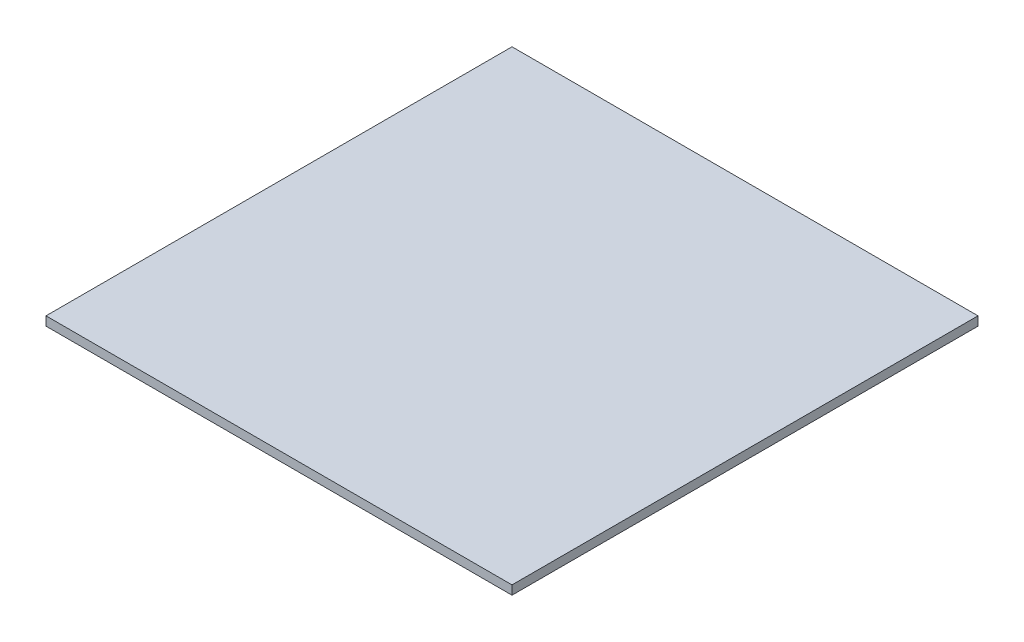
ISO-10303-21;
HEADER;
FILE_DESCRIPTION(('STEP AP214'),'2;1');
FILE_NAME('part.step','',(''),(''),'','','');
FILE_SCHEMA(('AUTOMOTIVE_DESIGN { 1 0 10303 214 1 1 1 1 }'));
ENDSEC;
DATA;
#1=APPLICATION_CONTEXT('core data for automotive mechanical design processes');
#2=APPLICATION_PROTOCOL_DEFINITION('international standard','automotive_design',2000,#1);
#3=PRODUCT_CONTEXT('',#1,'mechanical');
#4=PRODUCT('Part','Part','',(#3));
#5=PRODUCT_RELATED_PRODUCT_CATEGORY('part','',(#4));
#6=PRODUCT_DEFINITION_FORMATION('','',#4);
#7=PRODUCT_DEFINITION_CONTEXT('part definition',#1,'design');
#8=PRODUCT_DEFINITION('design','',#6,#7);
#9=PRODUCT_DEFINITION_SHAPE('','',#8);
#10=(LENGTH_UNIT() NAMED_UNIT(*) SI_UNIT(.MILLI.,.METRE.));
#11=(NAMED_UNIT(*) PLANE_ANGLE_UNIT() SI_UNIT($,.RADIAN.));
#12=(NAMED_UNIT(*) SI_UNIT($,.STERADIAN.) SOLID_ANGLE_UNIT());
#13=UNCERTAINTY_MEASURE_WITH_UNIT(LENGTH_MEASURE(1.E-05),#10,'distance_accuracy_value','');
#14=(GEOMETRIC_REPRESENTATION_CONTEXT(3) GLOBAL_UNCERTAINTY_ASSIGNED_CONTEXT((#13)) GLOBAL_UNIT_ASSIGNED_CONTEXT((#10,
#11,#12)) REPRESENTATION_CONTEXT('',''));
#15=CARTESIAN_POINT('',(0.,0.,0.));
#16=DIRECTION('',(0.,0.,1.));
#17=DIRECTION('',(1.,0.,0.));
#18=AXIS2_PLACEMENT_3D('',#15,#16,#17);
#19=CARTESIAN_POINT('',(65.,2.5,65.));
#20=DIRECTION('',(-1.,0.,0.));
#21=DIRECTION('',(0.,0.,1.));
#22=AXIS2_PLACEMENT_3D('',#19,#20,#21);
#23=PLANE('',#22);
#24=DIRECTION('',(0.,0.,-1.));
#25=VECTOR('',#24,1.);
#26=CARTESIAN_POINT('',(65.,0.,65.));
#27=LINE('',#26,#25);
#28=CARTESIAN_POINT('',(65.,0.,65.));
#29=VERTEX_POINT('',#28);
#30=CARTESIAN_POINT('',(65.,0.,-65.));
#31=VERTEX_POINT('',#30);
#32=EDGE_CURVE('E107',#29,#31,#27,.T.);
#33=ORIENTED_EDGE('',*,*,#32,.T.);
#34=DIRECTION('',(0.,-1.,0.));
#35=VECTOR('',#34,1.);
#36=CARTESIAN_POINT('',(65.,2.5,-65.));
#37=LINE('',#36,#35);
#38=CARTESIAN_POINT('',(65.,2.5,-65.));
#39=VERTEX_POINT('',#38);
#40=EDGE_CURVE('E11',#39,#31,#37,.T.);
#41=ORIENTED_EDGE('',*,*,#40,.F.);
#42=DIRECTION('',(0.,0.,-1.));
#43=VECTOR('',#42,1.);
#44=CARTESIAN_POINT('',(65.,2.5,65.));
#45=LINE('',#44,#43);
#46=CARTESIAN_POINT('',(65.,2.5,65.));
#47=VERTEX_POINT('',#46);
#48=EDGE_CURVE('E91',#47,#39,#45,.T.);
#49=ORIENTED_EDGE('',*,*,#48,.F.);
#50=DIRECTION('',(0.,-1.,0.));
#51=VECTOR('',#50,1.);
#52=CARTESIAN_POINT('',(65.,2.5,65.));
#53=LINE('',#52,#51);
#54=EDGE_CURVE('E103',#47,#29,#53,.T.);
#55=ORIENTED_EDGE('',*,*,#54,.T.);
#56=EDGE_LOOP('',(#33,#41,#49,#55));
#57=FACE_BOUND('',#56,.T.);
#58=ADVANCED_FACE('F39',(#57),#23,.F.);
#59=CARTESIAN_POINT('',(-65.,2.5,-65.));
#60=DIRECTION('',(0.,0.,1.));
#61=DIRECTION('',(1.,0.,0.));
#62=AXIS2_PLACEMENT_3D('',#59,#60,#61);
#63=PLANE('',#62);
#64=DIRECTION('',(-1.,0.,0.));
#65=VECTOR('',#64,1.);
#66=CARTESIAN_POINT('',(-65.,0.,-65.));
#67=LINE('',#66,#65);
#68=CARTESIAN_POINT('',(-65.,0.,-65.));
#69=VERTEX_POINT('',#68);
#70=EDGE_CURVE('E96',#31,#69,#67,.T.);
#71=ORIENTED_EDGE('',*,*,#70,.T.);
#72=DIRECTION('',(0.,-1.,0.));
#73=VECTOR('',#72,1.);
#74=CARTESIAN_POINT('',(-65.,2.5,-65.));
#75=LINE('',#74,#73);
#76=CARTESIAN_POINT('',(-65.,2.5,-65.));
#77=VERTEX_POINT('',#76);
#78=EDGE_CURVE('E48',#77,#69,#75,.T.);
#79=ORIENTED_EDGE('',*,*,#78,.F.);
#80=DIRECTION('',(-1.,0.,0.));
#81=VECTOR('',#80,1.);
#82=CARTESIAN_POINT('',(-65.,2.5,-65.));
#83=LINE('',#82,#81);
#84=EDGE_CURVE('E86',#39,#77,#83,.T.);
#85=ORIENTED_EDGE('',*,*,#84,.F.);
#86=ORIENTED_EDGE('',*,*,#40,.T.);
#87=EDGE_LOOP('',(#71,#79,#85,#86));
#88=FACE_BOUND('',#87,.T.);
#89=ADVANCED_FACE('F95',(#88),#63,.F.);
#90=CARTESIAN_POINT('',(-65.,2.5,65.));
#91=DIRECTION('',(1.,0.,0.));
#92=DIRECTION('',(0.,0.,-1.));
#93=AXIS2_PLACEMENT_3D('',#90,#91,#92);
#94=PLANE('',#93);
#95=DIRECTION('',(0.,0.,1.));
#96=VECTOR('',#95,1.);
#97=CARTESIAN_POINT('',(-65.,0.,65.));
#98=LINE('',#97,#96);
#99=CARTESIAN_POINT('',(-65.,0.,65.));
#100=VERTEX_POINT('',#99);
#101=EDGE_CURVE('E73',#69,#100,#98,.T.);
#102=ORIENTED_EDGE('',*,*,#101,.T.);
#103=DIRECTION('',(0.,-1.,0.));
#104=VECTOR('',#103,1.);
#105=CARTESIAN_POINT('',(-65.,2.5,65.));
#106=LINE('',#105,#104);
#107=CARTESIAN_POINT('',(-65.,2.5,65.));
#108=VERTEX_POINT('',#107);
#109=EDGE_CURVE('E98',#108,#100,#106,.T.);
#110=ORIENTED_EDGE('',*,*,#109,.F.);
#111=DIRECTION('',(0.,0.,1.));
#112=VECTOR('',#111,1.);
#113=CARTESIAN_POINT('',(-65.,2.5,65.));
#114=LINE('',#113,#112);
#115=EDGE_CURVE('E89',#77,#108,#114,.T.);
#116=ORIENTED_EDGE('',*,*,#115,.F.);
#117=ORIENTED_EDGE('',*,*,#78,.T.);
#118=EDGE_LOOP('',(#102,#110,#116,#117));
#119=FACE_BOUND('',#118,.T.);
#120=ADVANCED_FACE('F99',(#119),#94,.F.);
#121=CARTESIAN_POINT('',(-65.,2.5,65.));
#122=DIRECTION('',(0.,0.,-1.));
#123=DIRECTION('',(-1.,0.,0.));
#124=AXIS2_PLACEMENT_3D('',#121,#122,#123);
#125=PLANE('',#124);
#126=DIRECTION('',(1.,0.,0.));
#127=VECTOR('',#126,1.);
#128=CARTESIAN_POINT('',(-65.,0.,65.));
#129=LINE('',#128,#127);
#130=EDGE_CURVE('E79',#100,#29,#129,.T.);
#131=ORIENTED_EDGE('',*,*,#130,.T.);
#132=ORIENTED_EDGE('',*,*,#54,.F.);
#133=DIRECTION('',(1.,0.,0.));
#134=VECTOR('',#133,1.);
#135=CARTESIAN_POINT('',(-65.,2.5,65.));
#136=LINE('',#135,#134);
#137=EDGE_CURVE('E56',#108,#47,#136,.T.);
#138=ORIENTED_EDGE('',*,*,#137,.F.);
#139=ORIENTED_EDGE('',*,*,#109,.T.);
#140=EDGE_LOOP('',(#131,#132,#138,#139));
#141=FACE_BOUND('',#140,.T.);
#142=ADVANCED_FACE('F120',(#141),#125,.F.);
#143=CARTESIAN_POINT('',(0.,2.5,0.));
#144=DIRECTION('',(0.,-1.,0.));
#145=DIRECTION('',(0.,0.,-1.));
#146=AXIS2_PLACEMENT_3D('',#143,#144,#145);
#147=PLANE('',#146);
#148=ORIENTED_EDGE('',*,*,#48,.T.);
#149=ORIENTED_EDGE('',*,*,#84,.T.);
#150=ORIENTED_EDGE('',*,*,#115,.T.);
#151=ORIENTED_EDGE('',*,*,#137,.T.);
#152=EDGE_LOOP('',(#148,#149,#150,#151));
#153=FACE_BOUND('',#152,.T.);
#154=ADVANCED_FACE('F87',(#153),#147,.F.);
#155=CARTESIAN_POINT('',(0.,0.,0.));
#156=DIRECTION('',(0.,-1.,0.));
#157=DIRECTION('',(0.,0.,-1.));
#158=AXIS2_PLACEMENT_3D('',#155,#156,#157);
#159=PLANE('',#158);
#160=ORIENTED_EDGE('',*,*,#32,.F.);
#161=ORIENTED_EDGE('',*,*,#130,.F.);
#162=ORIENTED_EDGE('',*,*,#101,.F.);
#163=ORIENTED_EDGE('',*,*,#70,.F.);
#164=EDGE_LOOP('',(#160,#161,#162,#163));
#165=FACE_BOUND('',#164,.T.);
#166=ADVANCED_FACE('F123',(#165),#159,.T.);
#167=CLOSED_SHELL('',(#58,#89,#120,#142,#154,#166));
#168=MANIFOLD_SOLID_BREP('B2',#167);
#169=ADVANCED_BREP_SHAPE_REPRESENTATION('',(#18,#168),#14);
#170=SHAPE_DEFINITION_REPRESENTATION(#9,#169);
ENDSEC;
END-ISO-10303-21;
